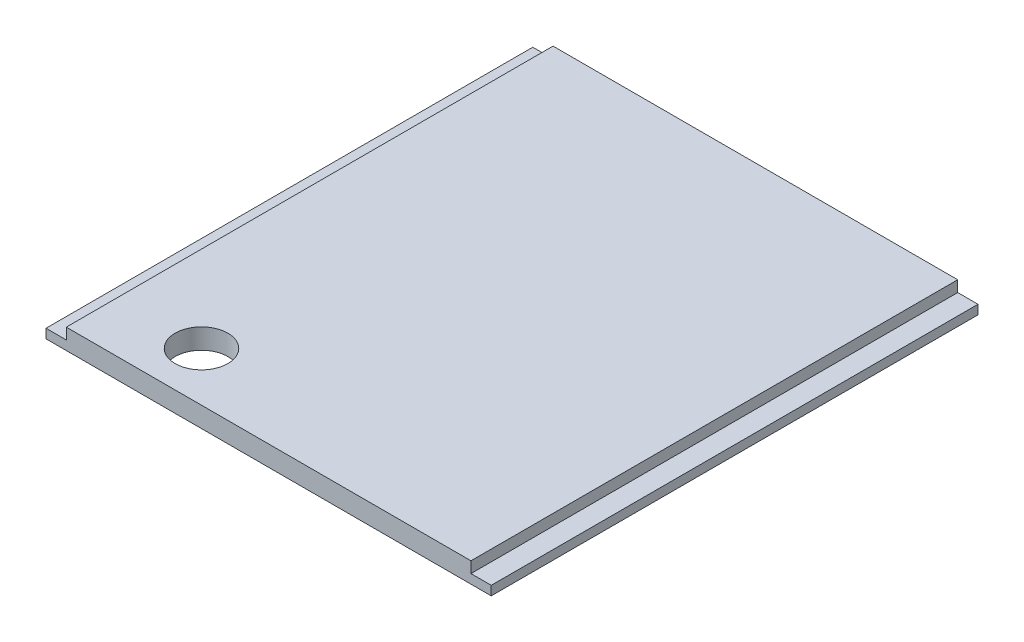
ISO-10303-21;
HEADER;
FILE_DESCRIPTION(('STEP AP214'),'2;1');
FILE_NAME('part.step','',(''),(''),'','','');
FILE_SCHEMA(('AUTOMOTIVE_DESIGN { 1 0 10303 214 1 1 1 1 }'));
ENDSEC;
DATA;
#1=APPLICATION_CONTEXT('core data for automotive mechanical design processes');
#2=APPLICATION_PROTOCOL_DEFINITION('international standard','automotive_design',2000,#1);
#3=PRODUCT_CONTEXT('',#1,'mechanical');
#4=PRODUCT('Part','Part','',(#3));
#5=PRODUCT_RELATED_PRODUCT_CATEGORY('part','',(#4));
#6=PRODUCT_DEFINITION_FORMATION('','',#4);
#7=PRODUCT_DEFINITION_CONTEXT('part definition',#1,'design');
#8=PRODUCT_DEFINITION('design','',#6,#7);
#9=PRODUCT_DEFINITION_SHAPE('','',#8);
#10=(LENGTH_UNIT() NAMED_UNIT(*) SI_UNIT(.MILLI.,.METRE.));
#11=(NAMED_UNIT(*) PLANE_ANGLE_UNIT() SI_UNIT($,.RADIAN.));
#12=(NAMED_UNIT(*) SI_UNIT($,.STERADIAN.) SOLID_ANGLE_UNIT());
#13=UNCERTAINTY_MEASURE_WITH_UNIT(LENGTH_MEASURE(1.E-05),#10,'distance_accuracy_value','');
#14=(GEOMETRIC_REPRESENTATION_CONTEXT(3) GLOBAL_UNCERTAINTY_ASSIGNED_CONTEXT((#13)) GLOBAL_UNIT_ASSIGNED_CONTEXT((#10,
#11,#12)) REPRESENTATION_CONTEXT('',''));
#15=CARTESIAN_POINT('',(0.,0.,0.));
#16=DIRECTION('',(0.,0.,1.));
#17=DIRECTION('',(1.,0.,0.));
#18=AXIS2_PLACEMENT_3D('',#15,#16,#17);
#19=CARTESIAN_POINT('',(0.,6.35,0.));
#20=DIRECTION('',(1.,0.,0.));
#21=DIRECTION('',(0.,0.,-1.));
#22=AXIS2_PLACEMENT_3D('',#19,#20,#21);
#23=PLANE('',#22);
#24=DIRECTION('',(0.,0.,1.));
#25=VECTOR('',#24,1.);
#26=CARTESIAN_POINT('',(0.,2.87528,-152.4));
#27=LINE('',#26,#25);
#28=CARTESIAN_POINT('',(0.,2.87528,-152.4));
#29=VERTEX_POINT('',#28);
#30=CARTESIAN_POINT('',(0.,2.87528,0.));
#31=VERTEX_POINT('',#30);
#32=EDGE_CURVE('E99',#29,#31,#27,.T.);
#33=ORIENTED_EDGE('',*,*,#32,.F.);
#34=DIRECTION('',(0.,-1.,0.));
#35=VECTOR('',#34,1.);
#36=CARTESIAN_POINT('',(0.,6.35,-152.4));
#37=LINE('',#36,#35);
#38=CARTESIAN_POINT('',(0.,0.,-152.4));
#39=VERTEX_POINT('',#38);
#40=EDGE_CURVE('E121',#29,#39,#37,.T.);
#41=ORIENTED_EDGE('',*,*,#40,.T.);
#42=DIRECTION('',(0.,0.,1.));
#43=VECTOR('',#42,1.);
#44=CARTESIAN_POINT('',(0.,0.,0.));
#45=LINE('',#44,#43);
#46=CARTESIAN_POINT('',(0.,0.,0.));
#47=VERTEX_POINT('',#46);
#48=EDGE_CURVE('E120',#39,#47,#45,.T.);
#49=ORIENTED_EDGE('',*,*,#48,.T.);
#50=DIRECTION('',(0.,-1.,0.));
#51=VECTOR('',#50,1.);
#52=CARTESIAN_POINT('',(0.,6.35,0.));
#53=LINE('',#52,#51);
#54=EDGE_CURVE('E11',#31,#47,#53,.T.);
#55=ORIENTED_EDGE('',*,*,#54,.F.);
#56=EDGE_LOOP('',(#33,#41,#49,#55));
#57=FACE_BOUND('',#56,.T.);
#58=ADVANCED_FACE('F36',(#57),#23,.F.);
#59=CARTESIAN_POINT('',(0.,6.35,0.));
#60=DIRECTION('',(0.,0.,-1.));
#61=DIRECTION('',(-1.,0.,0.));
#62=AXIS2_PLACEMENT_3D('',#59,#60,#61);
#63=PLANE('',#62);
#64=DIRECTION('',(1.,0.,0.));
#65=VECTOR('',#64,1.);
#66=CARTESIAN_POINT('',(0.,6.35,0.));
#67=LINE('',#66,#65);
#68=CARTESIAN_POINT('',(6.35000000000002,6.35,0.));
#69=VERTEX_POINT('',#68);
#70=CARTESIAN_POINT('',(133.05028,6.35,0.));
#71=VERTEX_POINT('',#70);
#72=EDGE_CURVE('E140',#69,#71,#67,.T.);
#73=ORIENTED_EDGE('',*,*,#72,.F.);
#74=DIRECTION('',(0.,1.,0.));
#75=VECTOR('',#74,1.);
#76=CARTESIAN_POINT('',(6.35000000000002,2.87528,0.));
#77=LINE('',#76,#75);
#78=CARTESIAN_POINT('',(6.35000000000002,2.87528,0.));
#79=VERTEX_POINT('',#78);
#80=EDGE_CURVE('E58',#79,#69,#77,.T.);
#81=ORIENTED_EDGE('',*,*,#80,.F.);
#82=DIRECTION('',(1.,0.,0.));
#83=VECTOR('',#82,1.);
#84=CARTESIAN_POINT('',(0.,2.87528,0.));
#85=LINE('',#84,#83);
#86=EDGE_CURVE('E103',#31,#79,#85,.T.);
#87=ORIENTED_EDGE('',*,*,#86,.F.);
#88=ORIENTED_EDGE('',*,*,#54,.T.);
#89=DIRECTION('',(1.,0.,0.));
#90=VECTOR('',#89,1.);
#91=CARTESIAN_POINT('',(0.,0.,0.));
#92=LINE('',#91,#90);
#93=CARTESIAN_POINT('',(139.40028,0.,0.));
#94=VERTEX_POINT('',#93);
#95=EDGE_CURVE('E125',#47,#94,#92,.T.);
#96=ORIENTED_EDGE('',*,*,#95,.T.);
#97=DIRECTION('',(0.,-1.,0.));
#98=VECTOR('',#97,1.);
#99=CARTESIAN_POINT('',(139.40028,6.35,0.));
#100=LINE('',#99,#98);
#101=CARTESIAN_POINT('',(139.40028,2.87528,0.));
#102=VERTEX_POINT('',#101);
#103=EDGE_CURVE('E43',#102,#94,#100,.T.);
#104=ORIENTED_EDGE('',*,*,#103,.F.);
#105=DIRECTION('',(1.,0.,0.));
#106=VECTOR('',#105,1.);
#107=CARTESIAN_POINT('',(139.40028,2.87528,0.));
#108=LINE('',#107,#106);
#109=CARTESIAN_POINT('',(133.05028,2.87528,0.));
#110=VERTEX_POINT('',#109);
#111=EDGE_CURVE('E162',#110,#102,#108,.T.);
#112=ORIENTED_EDGE('',*,*,#111,.F.);
#113=DIRECTION('',(0.,1.,0.));
#114=VECTOR('',#113,1.);
#115=CARTESIAN_POINT('',(133.05028,2.87528,0.));
#116=LINE('',#115,#114);
#117=EDGE_CURVE('E171',#110,#71,#116,.T.);
#118=ORIENTED_EDGE('',*,*,#117,.T.);
#119=EDGE_LOOP('',(#73,#81,#87,#88,#96,#104,#112,#118));
#120=FACE_BOUND('',#119,.T.);
#121=ADVANCED_FACE('F113',(#120),#63,.F.);
#122=CARTESIAN_POINT('',(139.40028,6.35,0.));
#123=DIRECTION('',(-1.,0.,0.));
#124=DIRECTION('',(0.,0.,1.));
#125=AXIS2_PLACEMENT_3D('',#122,#123,#124);
#126=PLANE('',#125);
#127=DIRECTION('',(0.,-1.,0.));
#128=VECTOR('',#127,1.);
#129=CARTESIAN_POINT('',(139.40028,6.35,-152.4));
#130=LINE('',#129,#128);
#131=CARTESIAN_POINT('',(139.40028,2.87528,-152.4));
#132=VERTEX_POINT('',#131);
#133=CARTESIAN_POINT('',(139.40028,0.,-152.4));
#134=VERTEX_POINT('',#133);
#135=EDGE_CURVE('E142',#132,#134,#130,.T.);
#136=ORIENTED_EDGE('',*,*,#135,.F.);
#137=DIRECTION('',(0.,0.,-1.));
#138=VECTOR('',#137,1.);
#139=CARTESIAN_POINT('',(139.40028,2.87528,-152.4));
#140=LINE('',#139,#138);
#141=EDGE_CURVE('E149',#102,#132,#140,.T.);
#142=ORIENTED_EDGE('',*,*,#141,.F.);
#143=ORIENTED_EDGE('',*,*,#103,.T.);
#144=DIRECTION('',(0.,0.,-1.));
#145=VECTOR('',#144,1.);
#146=CARTESIAN_POINT('',(139.40028,0.,0.));
#147=LINE('',#146,#145);
#148=EDGE_CURVE('E128',#94,#134,#147,.T.);
#149=ORIENTED_EDGE('',*,*,#148,.T.);
#150=EDGE_LOOP('',(#136,#142,#143,#149));
#151=FACE_BOUND('',#150,.T.);
#152=ADVANCED_FACE('F147',(#151),#126,.F.);
#153=CARTESIAN_POINT('',(0.,6.35,-152.4));
#154=DIRECTION('',(0.,0.,1.));
#155=DIRECTION('',(1.,0.,0.));
#156=AXIS2_PLACEMENT_3D('',#153,#154,#155);
#157=PLANE('',#156);
#158=DIRECTION('',(-1.,0.,0.));
#159=VECTOR('',#158,1.);
#160=CARTESIAN_POINT('',(0.,2.87528,-152.4));
#161=LINE('',#160,#159);
#162=CARTESIAN_POINT('',(6.35,2.87528,-152.4));
#163=VERTEX_POINT('',#162);
#164=EDGE_CURVE('E105',#163,#29,#161,.T.);
#165=ORIENTED_EDGE('',*,*,#164,.F.);
#166=DIRECTION('',(0.,1.,0.));
#167=VECTOR('',#166,1.);
#168=CARTESIAN_POINT('',(6.35,2.87528,-152.4));
#169=LINE('',#168,#167);
#170=CARTESIAN_POINT('',(6.35,6.35,-152.4));
#171=VERTEX_POINT('',#170);
#172=EDGE_CURVE('E126',#163,#171,#169,.T.);
#173=ORIENTED_EDGE('',*,*,#172,.T.);
#174=DIRECTION('',(-1.,0.,0.));
#175=VECTOR('',#174,1.);
#176=CARTESIAN_POINT('',(0.,6.35,-152.4));
#177=LINE('',#176,#175);
#178=CARTESIAN_POINT('',(133.05028,6.35,-152.4));
#179=VERTEX_POINT('',#178);
#180=EDGE_CURVE('E133',#179,#171,#177,.T.);
#181=ORIENTED_EDGE('',*,*,#180,.F.);
#182=DIRECTION('',(0.,1.,0.));
#183=VECTOR('',#182,1.);
#184=CARTESIAN_POINT('',(133.05028,2.87528,-152.4));
#185=LINE('',#184,#183);
#186=CARTESIAN_POINT('',(133.05028,2.87528,-152.4));
#187=VERTEX_POINT('',#186);
#188=EDGE_CURVE('E50',#187,#179,#185,.T.);
#189=ORIENTED_EDGE('',*,*,#188,.F.);
#190=DIRECTION('',(-1.,0.,0.));
#191=VECTOR('',#190,1.);
#192=CARTESIAN_POINT('',(139.40028,2.87528,-152.4));
#193=LINE('',#192,#191);
#194=EDGE_CURVE('E156',#132,#187,#193,.T.);
#195=ORIENTED_EDGE('',*,*,#194,.F.);
#196=ORIENTED_EDGE('',*,*,#135,.T.);
#197=DIRECTION('',(-1.,0.,0.));
#198=VECTOR('',#197,1.);
#199=CARTESIAN_POINT('',(0.,0.,-152.4));
#200=LINE('',#199,#198);
#201=EDGE_CURVE('E138',#134,#39,#200,.T.);
#202=ORIENTED_EDGE('',*,*,#201,.T.);
#203=ORIENTED_EDGE('',*,*,#40,.F.);
#204=EDGE_LOOP('',(#165,#173,#181,#189,#195,#196,#202,#203));
#205=FACE_BOUND('',#204,.T.);
#206=ADVANCED_FACE('F153',(#205),#157,.F.);
#207=CARTESIAN_POINT('',(0.,6.35,0.));
#208=DIRECTION('',(0.,-1.,0.));
#209=DIRECTION('',(0.,0.,-1.));
#210=AXIS2_PLACEMENT_3D('',#207,#208,#209);
#211=PLANE('',#210);
#212=CARTESIAN_POINT('',(33.274,6.35,-15.4084029017));
#213=DIRECTION('',(0.,1.,0.));
#214=DIRECTION('',(0.,0.,1.));
#215=AXIS2_PLACEMENT_3D('',#212,#213,#214);
#216=CIRCLE('',#215,8.255);
#217=CARTESIAN_POINT('',(33.274,6.35,-7.1534029017));
#218=VERTEX_POINT('',#217);
#219=EDGE_CURVE('E183',#218,#218,#216,.T.);
#220=ORIENTED_EDGE('',*,*,#219,.F.);
#221=EDGE_LOOP('',(#220));
#222=FACE_BOUND('',#221,.T.);
#223=ORIENTED_EDGE('',*,*,#180,.T.);
#224=DIRECTION('',(0.,0.,-1.));
#225=VECTOR('',#224,1.);
#226=CARTESIAN_POINT('',(6.35,6.35,-152.4));
#227=LINE('',#226,#225);
#228=EDGE_CURVE('E109',#69,#171,#227,.T.);
#229=ORIENTED_EDGE('',*,*,#228,.F.);
#230=ORIENTED_EDGE('',*,*,#72,.T.);
#231=DIRECTION('',(0.,0.,1.));
#232=VECTOR('',#231,1.);
#233=CARTESIAN_POINT('',(133.05028,6.35,-152.4));
#234=LINE('',#233,#232);
#235=EDGE_CURVE('E164',#179,#71,#234,.T.);
#236=ORIENTED_EDGE('',*,*,#235,.F.);
#237=EDGE_LOOP('',(#223,#229,#230,#236));
#238=FACE_BOUND('',#237,.T.);
#239=ADVANCED_FACE('F177',(#222,#238),#211,.F.);
#240=CARTESIAN_POINT('',(0.,0.,0.));
#241=DIRECTION('',(0.,-1.,0.));
#242=DIRECTION('',(0.,0.,-1.));
#243=AXIS2_PLACEMENT_3D('',#240,#241,#242);
#244=PLANE('',#243);
#245=CARTESIAN_POINT('',(33.274,0.,-15.4084029017));
#246=DIRECTION('',(0.,1.,0.));
#247=DIRECTION('',(0.,0.,1.));
#248=AXIS2_PLACEMENT_3D('',#245,#246,#247);
#249=CIRCLE('',#248,8.255);
#250=CARTESIAN_POINT('',(33.274,0.,-7.1534029017));
#251=VERTEX_POINT('',#250);
#252=EDGE_CURVE('E170',#251,#251,#249,.T.);
#253=ORIENTED_EDGE('',*,*,#252,.T.);
#254=EDGE_LOOP('',(#253));
#255=FACE_BOUND('',#254,.T.);
#256=ORIENTED_EDGE('',*,*,#48,.F.);
#257=ORIENTED_EDGE('',*,*,#201,.F.);
#258=ORIENTED_EDGE('',*,*,#148,.F.);
#259=ORIENTED_EDGE('',*,*,#95,.F.);
#260=EDGE_LOOP('',(#256,#257,#258,#259));
#261=FACE_BOUND('',#260,.T.);
#262=ADVANCED_FACE('F151',(#255,#261),#244,.T.);
#263=CARTESIAN_POINT('',(133.05028,2.87528,-152.4));
#264=DIRECTION('',(-1.,0.,0.));
#265=DIRECTION('',(0.,0.,1.));
#266=AXIS2_PLACEMENT_3D('',#263,#264,#265);
#267=PLANE('',#266);
#268=ORIENTED_EDGE('',*,*,#235,.T.);
#269=ORIENTED_EDGE('',*,*,#117,.F.);
#270=DIRECTION('',(0.,0.,1.));
#271=VECTOR('',#270,1.);
#272=CARTESIAN_POINT('',(133.05028,2.87528,-152.4));
#273=LINE('',#272,#271);
#274=EDGE_CURVE('E160',#187,#110,#273,.T.);
#275=ORIENTED_EDGE('',*,*,#274,.F.);
#276=ORIENTED_EDGE('',*,*,#188,.T.);
#277=EDGE_LOOP('',(#268,#269,#275,#276));
#278=FACE_BOUND('',#277,.T.);
#279=ADVANCED_FACE('F202',(#278),#267,.F.);
#280=CARTESIAN_POINT('',(0.,2.87528,0.));
#281=DIRECTION('',(0.,-1.,0.));
#282=DIRECTION('',(0.,0.,-1.));
#283=AXIS2_PLACEMENT_3D('',#280,#281,#282);
#284=PLANE('',#283);
#285=ORIENTED_EDGE('',*,*,#141,.T.);
#286=ORIENTED_EDGE('',*,*,#194,.T.);
#287=ORIENTED_EDGE('',*,*,#274,.T.);
#288=ORIENTED_EDGE('',*,*,#111,.T.);
#289=EDGE_LOOP('',(#285,#286,#287,#288));
#290=FACE_BOUND('',#289,.T.);
#291=ADVANCED_FACE('F239',(#290),#284,.F.);
#292=CARTESIAN_POINT('',(6.35,2.87528,-152.4));
#293=DIRECTION('',(1.,0.,0.));
#294=DIRECTION('',(0.,0.,-1.));
#295=AXIS2_PLACEMENT_3D('',#292,#293,#294);
#296=PLANE('',#295);
#297=ORIENTED_EDGE('',*,*,#228,.T.);
#298=ORIENTED_EDGE('',*,*,#172,.F.);
#299=DIRECTION('',(0.,0.,-1.));
#300=VECTOR('',#299,1.);
#301=CARTESIAN_POINT('',(6.35,2.87528,-152.4));
#302=LINE('',#301,#300);
#303=EDGE_CURVE('E116',#79,#163,#302,.T.);
#304=ORIENTED_EDGE('',*,*,#303,.F.);
#305=ORIENTED_EDGE('',*,*,#80,.T.);
#306=EDGE_LOOP('',(#297,#298,#304,#305));
#307=FACE_BOUND('',#306,.T.);
#308=ADVANCED_FACE('F178',(#307),#296,.F.);
#309=CARTESIAN_POINT('',(0.,2.87528,0.));
#310=DIRECTION('',(0.,1.,0.));
#311=DIRECTION('',(0.,0.,1.));
#312=AXIS2_PLACEMENT_3D('',#309,#310,#311);
#313=PLANE('',#312);
#314=ORIENTED_EDGE('',*,*,#32,.T.);
#315=ORIENTED_EDGE('',*,*,#86,.T.);
#316=ORIENTED_EDGE('',*,*,#303,.T.);
#317=ORIENTED_EDGE('',*,*,#164,.T.);
#318=EDGE_LOOP('',(#314,#315,#316,#317));
#319=FACE_BOUND('',#318,.T.);
#320=ADVANCED_FACE('F101',(#319),#313,.T.);
#321=CARTESIAN_POINT('',(33.274,0.,-15.4084029017));
#322=DIRECTION('',(0.,1.,0.));
#323=DIRECTION('',(0.,0.,1.));
#324=AXIS2_PLACEMENT_3D('',#321,#322,#323);
#325=CYLINDRICAL_SURFACE('',#324,8.255);
#326=ORIENTED_EDGE('',*,*,#252,.F.);
#327=EDGE_LOOP('',(#326));
#328=FACE_BOUND('',#327,.T.);
#329=ORIENTED_EDGE('',*,*,#219,.T.);
#330=EDGE_LOOP('',(#329));
#331=FACE_BOUND('',#330,.T.);
#332=ADVANCED_FACE('F190',(#328,#331),#325,.F.);
#333=CLOSED_SHELL('',(#58,#121,#152,#206,#239,#262,#279,#291,#308,#320,#332));
#334=MANIFOLD_SOLID_BREP('B2',#333);
#335=ADVANCED_BREP_SHAPE_REPRESENTATION('',(#18,#334),#14);
#336=SHAPE_DEFINITION_REPRESENTATION(#9,#335);
ENDSEC;
END-ISO-10303-21;
